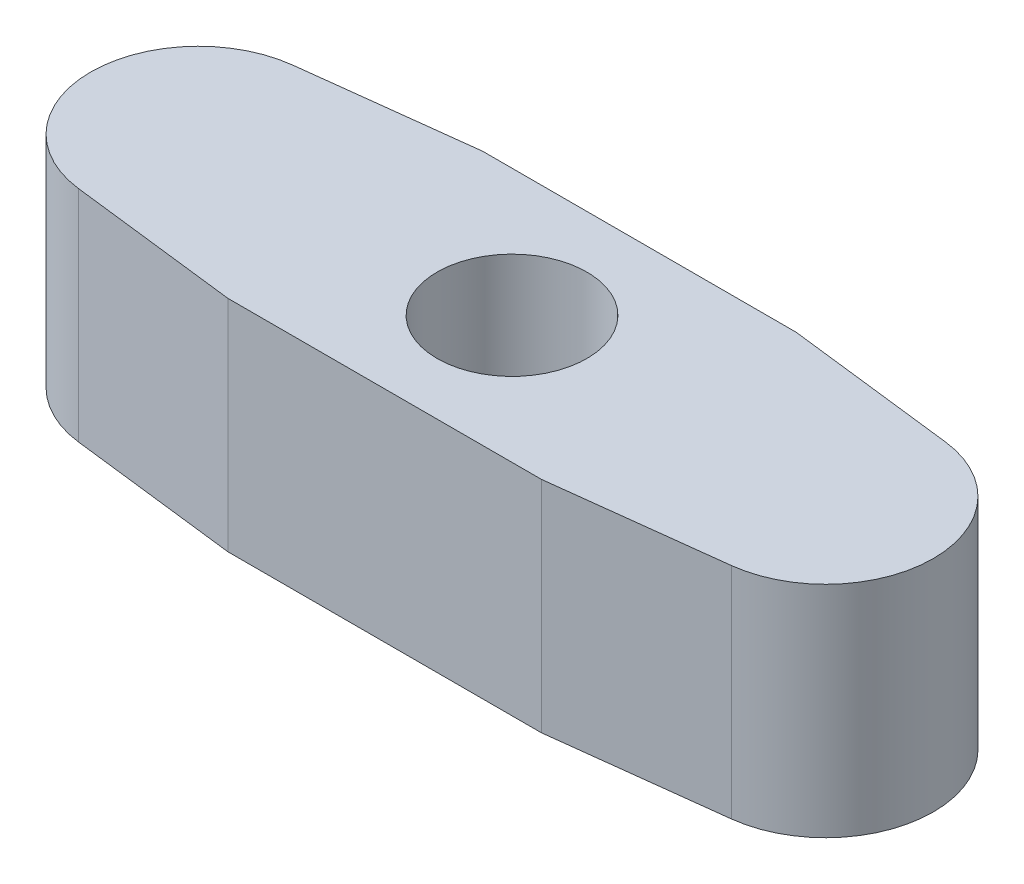
ISO-10303-21;
HEADER;
FILE_DESCRIPTION(('STEP AP214'),'2;1');
FILE_NAME('part.step','',(''),(''),'','','');
FILE_SCHEMA(('AUTOMOTIVE_DESIGN { 1 0 10303 214 1 1 1 1 }'));
ENDSEC;
DATA;
#1=APPLICATION_CONTEXT('core data for automotive mechanical design processes');
#2=APPLICATION_PROTOCOL_DEFINITION('international standard','automotive_design',2000,#1);
#3=PRODUCT_CONTEXT('',#1,'mechanical');
#4=PRODUCT('Part','Part','',(#3));
#5=PRODUCT_RELATED_PRODUCT_CATEGORY('part','',(#4));
#6=PRODUCT_DEFINITION_FORMATION('','',#4);
#7=PRODUCT_DEFINITION_CONTEXT('part definition',#1,'design');
#8=PRODUCT_DEFINITION('design','',#6,#7);
#9=PRODUCT_DEFINITION_SHAPE('','',#8);
#10=(LENGTH_UNIT() NAMED_UNIT(*) SI_UNIT(.MILLI.,.METRE.));
#11=(NAMED_UNIT(*) PLANE_ANGLE_UNIT() SI_UNIT($,.RADIAN.));
#12=(NAMED_UNIT(*) SI_UNIT($,.STERADIAN.) SOLID_ANGLE_UNIT());
#13=UNCERTAINTY_MEASURE_WITH_UNIT(LENGTH_MEASURE(1.E-05),#10,'distance_accuracy_value','');
#14=(GEOMETRIC_REPRESENTATION_CONTEXT(3) GLOBAL_UNCERTAINTY_ASSIGNED_CONTEXT((#13)) GLOBAL_UNIT_ASSIGNED_CONTEXT((#10,
#11,#12)) REPRESENTATION_CONTEXT('',''));
#15=CARTESIAN_POINT('',(0.,0.,0.));
#16=DIRECTION('',(0.,0.,1.));
#17=DIRECTION('',(1.,0.,0.));
#18=AXIS2_PLACEMENT_3D('',#15,#16,#17);
#19=CARTESIAN_POINT('',(-8.,5.6,0.));
#20=DIRECTION('',(0.,-1.,0.));
#21=DIRECTION('',(0.,0.,-1.));
#22=AXIS2_PLACEMENT_3D('',#19,#20,#21);
#23=PLANE('',#22);
#24=CARTESIAN_POINT('',(-8.,5.6,0.));
#25=DIRECTION('',(0.,1.,0.));
#26=DIRECTION('',(0.,0.,-1.));
#27=AXIS2_PLACEMENT_3D('',#24,#25,#26);
#28=CIRCLE('',#27,2.75);
#29=CARTESIAN_POINT('',(-8.32781776217957,5.6,-2.73039109191331));
#30=VERTEX_POINT('',#29);
#31=CARTESIAN_POINT('',(-8.32781776217957,5.6,2.73039109191332));
#32=VERTEX_POINT('',#31);
#33=EDGE_CURVE('E145',#30,#32,#28,.T.);
#34=ORIENTED_EDGE('',*,*,#33,.T.);
#35=DIRECTION('',(0.992869487968478,0.,0.119206458974388));
#36=VECTOR('',#35,1.);
#37=CARTESIAN_POINT('',(-4.,5.6,3.25));
#38=LINE('',#37,#36);
#39=CARTESIAN_POINT('',(-4.,5.6,3.25));
#40=VERTEX_POINT('',#39);
#41=EDGE_CURVE('E93',#32,#40,#38,.T.);
#42=ORIENTED_EDGE('',*,*,#41,.T.);
#43=DIRECTION('',(1.,0.,0.));
#44=VECTOR('',#43,1.);
#45=CARTESIAN_POINT('',(-4.,5.6,3.25));
#46=LINE('',#45,#44);
#47=CARTESIAN_POINT('',(4.,5.6,3.25));
#48=VERTEX_POINT('',#47);
#49=EDGE_CURVE('E160',#40,#48,#46,.T.);
#50=ORIENTED_EDGE('',*,*,#49,.T.);
#51=DIRECTION('',(0.992869487968478,0.,-0.119206458974388));
#52=VECTOR('',#51,1.);
#53=CARTESIAN_POINT('',(4.,5.6,3.25));
#54=LINE('',#53,#52);
#55=CARTESIAN_POINT('',(8.32781776217957,5.6,2.73039109191331));
#56=VERTEX_POINT('',#55);
#57=EDGE_CURVE('E173',#48,#56,#54,.T.);
#58=ORIENTED_EDGE('',*,*,#57,.T.);
#59=CARTESIAN_POINT('',(8.,5.6,0.));
#60=DIRECTION('',(0.,1.,0.));
#61=DIRECTION('',(0.,0.,1.));
#62=AXIS2_PLACEMENT_3D('',#59,#60,#61);
#63=CIRCLE('',#62,2.75);
#64=CARTESIAN_POINT('',(8.32781776217957,5.6,-2.73039109191331));
#65=VERTEX_POINT('',#64);
#66=EDGE_CURVE('E112',#56,#65,#63,.T.);
#67=ORIENTED_EDGE('',*,*,#66,.T.);
#68=DIRECTION('',(-0.992869487968478,0.,-0.119206458974388));
#69=VECTOR('',#68,1.);
#70=CARTESIAN_POINT('',(4.,5.6,-3.25));
#71=LINE('',#70,#69);
#72=CARTESIAN_POINT('',(4.,5.6,-3.25));
#73=VERTEX_POINT('',#72);
#74=EDGE_CURVE('E106',#65,#73,#71,.T.);
#75=ORIENTED_EDGE('',*,*,#74,.T.);
#76=DIRECTION('',(-1.,0.,0.));
#77=VECTOR('',#76,1.);
#78=CARTESIAN_POINT('',(-4.,5.6,-3.25));
#79=LINE('',#78,#77);
#80=CARTESIAN_POINT('',(-4.,5.6,-3.25));
#81=VERTEX_POINT('',#80);
#82=EDGE_CURVE('E110',#73,#81,#79,.T.);
#83=ORIENTED_EDGE('',*,*,#82,.T.);
#84=DIRECTION('',(-0.992869487968478,0.,0.119206458974389));
#85=VECTOR('',#84,1.);
#86=CARTESIAN_POINT('',(-4.,5.6,-3.25));
#87=LINE('',#86,#85);
#88=EDGE_CURVE('E50',#81,#30,#87,.T.);
#89=ORIENTED_EDGE('',*,*,#88,.T.);
#90=EDGE_LOOP('',(#34,#42,#50,#58,#67,#75,#83,#89));
#91=FACE_BOUND('',#90,.T.);
#92=CARTESIAN_POINT('',(0.,5.6,0.));
#93=DIRECTION('',(0.,1.,0.));
#94=DIRECTION('',(0.,0.,1.));
#95=AXIS2_PLACEMENT_3D('',#92,#93,#94);
#96=CIRCLE('',#95,1.91142565847948);
#97=CARTESIAN_POINT('',(0.,5.6,1.91142565847948));
#98=VERTEX_POINT('',#97);
#99=EDGE_CURVE('E134',#98,#98,#96,.T.);
#100=ORIENTED_EDGE('',*,*,#99,.F.);
#101=EDGE_LOOP('',(#100));
#102=FACE_BOUND('',#101,.T.);
#103=ADVANCED_FACE('F33',(#91,#102),#23,.F.);
#104=CARTESIAN_POINT('',(-8.,0.,0.));
#105=DIRECTION('',(0.,-1.,0.));
#106=DIRECTION('',(0.,0.,-1.));
#107=AXIS2_PLACEMENT_3D('',#104,#105,#106);
#108=PLANE('',#107);
#109=CARTESIAN_POINT('',(-8.,0.,0.));
#110=DIRECTION('',(0.,1.,0.));
#111=DIRECTION('',(0.,0.,-1.));
#112=AXIS2_PLACEMENT_3D('',#109,#110,#111);
#113=CIRCLE('',#112,2.75);
#114=CARTESIAN_POINT('',(-8.32781776217957,0.,-2.73039109191331));
#115=VERTEX_POINT('',#114);
#116=CARTESIAN_POINT('',(-8.32781776217957,0.,2.73039109191332));
#117=VERTEX_POINT('',#116);
#118=EDGE_CURVE('E130',#115,#117,#113,.T.);
#119=ORIENTED_EDGE('',*,*,#118,.F.);
#120=DIRECTION('',(-0.992869487968478,0.,0.119206458974389));
#121=VECTOR('',#120,1.);
#122=CARTESIAN_POINT('',(-4.,0.,-3.25));
#123=LINE('',#122,#121);
#124=CARTESIAN_POINT('',(-4.,0.,-3.25));
#125=VERTEX_POINT('',#124);
#126=EDGE_CURVE('E85',#125,#115,#123,.T.);
#127=ORIENTED_EDGE('',*,*,#126,.F.);
#128=DIRECTION('',(-1.,0.,0.));
#129=VECTOR('',#128,1.);
#130=CARTESIAN_POINT('',(-4.,0.,-3.25));
#131=LINE('',#130,#129);
#132=CARTESIAN_POINT('',(4.,0.,-3.25));
#133=VERTEX_POINT('',#132);
#134=EDGE_CURVE('E79',#133,#125,#131,.T.);
#135=ORIENTED_EDGE('',*,*,#134,.F.);
#136=DIRECTION('',(-0.992869487968478,0.,-0.119206458974388));
#137=VECTOR('',#136,1.);
#138=CARTESIAN_POINT('',(4.,0.,-3.25));
#139=LINE('',#138,#137);
#140=CARTESIAN_POINT('',(8.32781776217957,0.,-2.73039109191331));
#141=VERTEX_POINT('',#140);
#142=EDGE_CURVE('E120',#141,#133,#139,.T.);
#143=ORIENTED_EDGE('',*,*,#142,.F.);
#144=CARTESIAN_POINT('',(8.,0.,0.));
#145=DIRECTION('',(0.,1.,0.));
#146=DIRECTION('',(0.,0.,1.));
#147=AXIS2_PLACEMENT_3D('',#144,#145,#146);
#148=CIRCLE('',#147,2.75);
#149=CARTESIAN_POINT('',(8.32781776217957,0.,2.73039109191331));
#150=VERTEX_POINT('',#149);
#151=EDGE_CURVE('E140',#150,#141,#148,.T.);
#152=ORIENTED_EDGE('',*,*,#151,.F.);
#153=DIRECTION('',(0.992869487968478,0.,-0.119206458974388));
#154=VECTOR('',#153,1.);
#155=CARTESIAN_POINT('',(4.,0.,3.25));
#156=LINE('',#155,#154);
#157=CARTESIAN_POINT('',(4.,0.,3.25));
#158=VERTEX_POINT('',#157);
#159=EDGE_CURVE('E138',#158,#150,#156,.T.);
#160=ORIENTED_EDGE('',*,*,#159,.F.);
#161=DIRECTION('',(1.,0.,0.));
#162=VECTOR('',#161,1.);
#163=CARTESIAN_POINT('',(-4.,0.,3.25));
#164=LINE('',#163,#162);
#165=CARTESIAN_POINT('',(-4.,0.,3.25));
#166=VERTEX_POINT('',#165);
#167=EDGE_CURVE('E136',#166,#158,#164,.T.);
#168=ORIENTED_EDGE('',*,*,#167,.F.);
#169=DIRECTION('',(0.992869487968478,0.,0.119206458974388));
#170=VECTOR('',#169,1.);
#171=CARTESIAN_POINT('',(-4.,0.,3.25));
#172=LINE('',#171,#170);
#173=EDGE_CURVE('E133',#117,#166,#172,.T.);
#174=ORIENTED_EDGE('',*,*,#173,.F.);
#175=EDGE_LOOP('',(#119,#127,#135,#143,#152,#160,#168,#174));
#176=FACE_BOUND('',#175,.T.);
#177=CARTESIAN_POINT('',(0.,0.,0.));
#178=DIRECTION('',(0.,1.,0.));
#179=DIRECTION('',(0.,0.,1.));
#180=AXIS2_PLACEMENT_3D('',#177,#178,#179);
#181=CIRCLE('',#180,1.91142565847948);
#182=CARTESIAN_POINT('',(0.,0.,1.91142565847948));
#183=VERTEX_POINT('',#182);
#184=EDGE_CURVE('E179',#183,#183,#181,.T.);
#185=ORIENTED_EDGE('',*,*,#184,.T.);
#186=EDGE_LOOP('',(#185));
#187=FACE_BOUND('',#186,.T.);
#188=ADVANCED_FACE('F164',(#176,#187),#108,.T.);
#189=CARTESIAN_POINT('',(-8.,5.6,0.));
#190=DIRECTION('',(0.,-1.,0.));
#191=DIRECTION('',(0.,0.,-1.));
#192=AXIS2_PLACEMENT_3D('',#189,#190,#191);
#193=CYLINDRICAL_SURFACE('',#192,2.75);
#194=ORIENTED_EDGE('',*,*,#118,.T.);
#195=DIRECTION('',(0.,-1.,0.));
#196=VECTOR('',#195,1.);
#197=CARTESIAN_POINT('',(-8.32781776217957,5.6,2.73039109191332));
#198=LINE('',#197,#196);
#199=EDGE_CURVE('E11',#32,#117,#198,.T.);
#200=ORIENTED_EDGE('',*,*,#199,.F.);
#201=ORIENTED_EDGE('',*,*,#33,.F.);
#202=DIRECTION('',(0.,-1.,0.));
#203=VECTOR('',#202,1.);
#204=CARTESIAN_POINT('',(-8.32781776217957,5.6,-2.73039109191331));
#205=LINE('',#204,#203);
#206=EDGE_CURVE('E126',#30,#115,#205,.T.);
#207=ORIENTED_EDGE('',*,*,#206,.T.);
#208=EDGE_LOOP('',(#194,#200,#201,#207));
#209=FACE_BOUND('',#208,.T.);
#210=ADVANCED_FACE('F35',(#209),#193,.T.);
#211=CARTESIAN_POINT('',(-4.,5.6,3.25));
#212=DIRECTION('',(0.119206458974388,0.,-0.992869487968478));
#213=DIRECTION('',(-0.992869487968478,0.,-0.119206458974388));
#214=AXIS2_PLACEMENT_3D('',#211,#212,#213);
#215=PLANE('',#214);
#216=ORIENTED_EDGE('',*,*,#173,.T.);
#217=DIRECTION('',(0.,-1.,0.));
#218=VECTOR('',#217,1.);
#219=CARTESIAN_POINT('',(-4.,5.6,3.25));
#220=LINE('',#219,#218);
#221=EDGE_CURVE('E42',#40,#166,#220,.T.);
#222=ORIENTED_EDGE('',*,*,#221,.F.);
#223=ORIENTED_EDGE('',*,*,#41,.F.);
#224=ORIENTED_EDGE('',*,*,#199,.T.);
#225=EDGE_LOOP('',(#216,#222,#223,#224));
#226=FACE_BOUND('',#225,.T.);
#227=ADVANCED_FACE('F207',(#226),#215,.F.);
#228=CARTESIAN_POINT('',(-4.,5.6,3.25));
#229=DIRECTION('',(0.,0.,-1.));
#230=DIRECTION('',(-1.,0.,0.));
#231=AXIS2_PLACEMENT_3D('',#228,#229,#230);
#232=PLANE('',#231);
#233=ORIENTED_EDGE('',*,*,#167,.T.);
#234=DIRECTION('',(0.,-1.,0.));
#235=VECTOR('',#234,1.);
#236=CARTESIAN_POINT('',(4.,5.6,3.25));
#237=LINE('',#236,#235);
#238=EDGE_CURVE('E152',#48,#158,#237,.T.);
#239=ORIENTED_EDGE('',*,*,#238,.F.);
#240=ORIENTED_EDGE('',*,*,#49,.F.);
#241=ORIENTED_EDGE('',*,*,#221,.T.);
#242=EDGE_LOOP('',(#233,#239,#240,#241));
#243=FACE_BOUND('',#242,.T.);
#244=ADVANCED_FACE('F158',(#243),#232,.F.);
#245=CARTESIAN_POINT('',(4.,5.6,3.25));
#246=DIRECTION('',(-0.119206458974388,0.,-0.992869487968478));
#247=DIRECTION('',(-0.992869487968478,0.,0.119206458974388));
#248=AXIS2_PLACEMENT_3D('',#245,#246,#247);
#249=PLANE('',#248);
#250=ORIENTED_EDGE('',*,*,#159,.T.);
#251=DIRECTION('',(0.,-1.,0.));
#252=VECTOR('',#251,1.);
#253=CARTESIAN_POINT('',(8.32781776217957,5.6,2.73039109191331));
#254=LINE('',#253,#252);
#255=EDGE_CURVE('E149',#56,#150,#254,.T.);
#256=ORIENTED_EDGE('',*,*,#255,.F.);
#257=ORIENTED_EDGE('',*,*,#57,.F.);
#258=ORIENTED_EDGE('',*,*,#238,.T.);
#259=EDGE_LOOP('',(#250,#256,#257,#258));
#260=FACE_BOUND('',#259,.T.);
#261=ADVANCED_FACE('F169',(#260),#249,.F.);
#262=CARTESIAN_POINT('',(8.,5.6,0.));
#263=DIRECTION('',(0.,-1.,0.));
#264=DIRECTION('',(0.,0.,-1.));
#265=AXIS2_PLACEMENT_3D('',#262,#263,#264);
#266=CYLINDRICAL_SURFACE('',#265,2.75);
#267=ORIENTED_EDGE('',*,*,#151,.T.);
#268=DIRECTION('',(0.,-1.,0.));
#269=VECTOR('',#268,1.);
#270=CARTESIAN_POINT('',(8.32781776217957,5.6,-2.73039109191331));
#271=LINE('',#270,#269);
#272=EDGE_CURVE('E121',#65,#141,#271,.T.);
#273=ORIENTED_EDGE('',*,*,#272,.F.);
#274=ORIENTED_EDGE('',*,*,#66,.F.);
#275=ORIENTED_EDGE('',*,*,#255,.T.);
#276=EDGE_LOOP('',(#267,#273,#274,#275));
#277=FACE_BOUND('',#276,.T.);
#278=ADVANCED_FACE('F172',(#277),#266,.T.);
#279=CARTESIAN_POINT('',(4.,5.6,-3.25));
#280=DIRECTION('',(-0.119206458974388,0.,0.992869487968478));
#281=DIRECTION('',(0.992869487968478,0.,0.119206458974388));
#282=AXIS2_PLACEMENT_3D('',#279,#280,#281);
#283=PLANE('',#282);
#284=ORIENTED_EDGE('',*,*,#142,.T.);
#285=DIRECTION('',(0.,-1.,0.));
#286=VECTOR('',#285,1.);
#287=CARTESIAN_POINT('',(4.,5.6,-3.25));
#288=LINE('',#287,#286);
#289=EDGE_CURVE('E117',#73,#133,#288,.T.);
#290=ORIENTED_EDGE('',*,*,#289,.F.);
#291=ORIENTED_EDGE('',*,*,#74,.F.);
#292=ORIENTED_EDGE('',*,*,#272,.T.);
#293=EDGE_LOOP('',(#284,#290,#291,#292));
#294=FACE_BOUND('',#293,.T.);
#295=ADVANCED_FACE('F118',(#294),#283,.F.);
#296=CARTESIAN_POINT('',(-4.,5.6,-3.25));
#297=DIRECTION('',(0.,0.,1.));
#298=DIRECTION('',(1.,0.,0.));
#299=AXIS2_PLACEMENT_3D('',#296,#297,#298);
#300=PLANE('',#299);
#301=ORIENTED_EDGE('',*,*,#134,.T.);
#302=DIRECTION('',(0.,-1.,0.));
#303=VECTOR('',#302,1.);
#304=CARTESIAN_POINT('',(-4.,5.6,-3.25));
#305=LINE('',#304,#303);
#306=EDGE_CURVE('E122',#81,#125,#305,.T.);
#307=ORIENTED_EDGE('',*,*,#306,.F.);
#308=ORIENTED_EDGE('',*,*,#82,.F.);
#309=ORIENTED_EDGE('',*,*,#289,.T.);
#310=EDGE_LOOP('',(#301,#307,#308,#309));
#311=FACE_BOUND('',#310,.T.);
#312=ADVANCED_FACE('F124',(#311),#300,.F.);
#313=CARTESIAN_POINT('',(-4.,5.6,-3.25));
#314=DIRECTION('',(0.119206458974389,0.,0.992869487968478));
#315=DIRECTION('',(0.992869487968478,0.,-0.119206458974389));
#316=AXIS2_PLACEMENT_3D('',#313,#314,#315);
#317=PLANE('',#316);
#318=ORIENTED_EDGE('',*,*,#126,.T.);
#319=ORIENTED_EDGE('',*,*,#206,.F.);
#320=ORIENTED_EDGE('',*,*,#88,.F.);
#321=ORIENTED_EDGE('',*,*,#306,.T.);
#322=EDGE_LOOP('',(#318,#319,#320,#321));
#323=FACE_BOUND('',#322,.T.);
#324=ADVANCED_FACE('F195',(#323),#317,.F.);
#325=CARTESIAN_POINT('',(0.,5.6,0.));
#326=DIRECTION('',(0.,-1.,0.));
#327=DIRECTION('',(0.,0.,-1.));
#328=AXIS2_PLACEMENT_3D('',#325,#326,#327);
#329=CYLINDRICAL_SURFACE('',#328,1.91142565847948);
#330=ORIENTED_EDGE('',*,*,#99,.T.);
#331=EDGE_LOOP('',(#330));
#332=FACE_BOUND('',#331,.T.);
#333=ORIENTED_EDGE('',*,*,#184,.F.);
#334=EDGE_LOOP('',(#333));
#335=FACE_BOUND('',#334,.T.);
#336=ADVANCED_FACE('F185',(#332,#335),#329,.F.);
#337=CLOSED_SHELL('',(#103,#188,#210,#227,#244,#261,#278,#295,#312,#324,#336));
#338=MANIFOLD_SOLID_BREP('B2',#337);
#339=ADVANCED_BREP_SHAPE_REPRESENTATION('',(#18,#338),#14);
#340=SHAPE_DEFINITION_REPRESENTATION(#9,#339);
ENDSEC;
END-ISO-10303-21;
